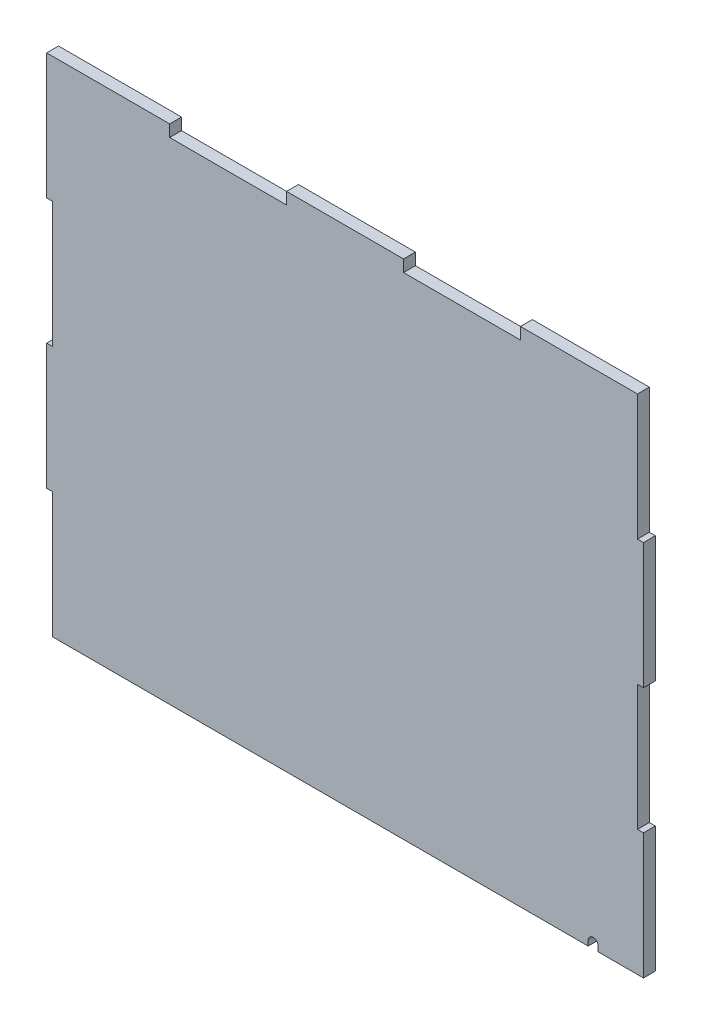
ISO-10303-21;
HEADER;
FILE_DESCRIPTION(('STEP AP214'),'2;1');
FILE_NAME('part.step','',(''),(''),'','','');
FILE_SCHEMA(('AUTOMOTIVE_DESIGN { 1 0 10303 214 1 1 1 1 }'));
ENDSEC;
DATA;
#1=APPLICATION_CONTEXT('core data for automotive mechanical design processes');
#2=APPLICATION_PROTOCOL_DEFINITION('international standard','automotive_design',2000,#1);
#3=PRODUCT_CONTEXT('',#1,'mechanical');
#4=PRODUCT('Part','Part','',(#3));
#5=PRODUCT_RELATED_PRODUCT_CATEGORY('part','',(#4));
#6=PRODUCT_DEFINITION_FORMATION('','',#4);
#7=PRODUCT_DEFINITION_CONTEXT('part definition',#1,'design');
#8=PRODUCT_DEFINITION('design','',#6,#7);
#9=PRODUCT_DEFINITION_SHAPE('','',#8);
#10=(LENGTH_UNIT() NAMED_UNIT(*) SI_UNIT(.MILLI.,.METRE.));
#11=(NAMED_UNIT(*) PLANE_ANGLE_UNIT() SI_UNIT($,.RADIAN.));
#12=(NAMED_UNIT(*) SI_UNIT($,.STERADIAN.) SOLID_ANGLE_UNIT());
#13=UNCERTAINTY_MEASURE_WITH_UNIT(LENGTH_MEASURE(1.E-05),#10,'distance_accuracy_value','');
#14=(GEOMETRIC_REPRESENTATION_CONTEXT(3) GLOBAL_UNCERTAINTY_ASSIGNED_CONTEXT((#13)) GLOBAL_UNIT_ASSIGNED_CONTEXT((#10,
#11,#12)) REPRESENTATION_CONTEXT('',''));
#15=CARTESIAN_POINT('',(0.,0.,0.));
#16=DIRECTION('',(0.,0.,1.));
#17=DIRECTION('',(1.,0.,0.));
#18=AXIS2_PLACEMENT_3D('',#15,#16,#17);
#19=CARTESIAN_POINT('',(0.,0.,5.9944));
#20=DIRECTION('',(0.,1.,0.));
#21=DIRECTION('',(0.,0.,1.));
#22=AXIS2_PLACEMENT_3D('',#19,#20,#21);
#23=PLANE('',#22);
#24=DIRECTION('',(0.,0.,1.));
#25=VECTOR('',#24,1.);
#26=CARTESIAN_POINT('',(275.59,0.,-0.00100000000000013));
#27=LINE('',#26,#25);
#28=CARTESIAN_POINT('',(275.59,0.,0.));
#29=VERTEX_POINT('',#28);
#30=CARTESIAN_POINT('',(275.59,0.,5.9944));
#31=VERTEX_POINT('',#30);
#32=EDGE_CURVE('E423',#29,#31,#27,.T.);
#33=ORIENTED_EDGE('',*,*,#32,.F.);
#34=DIRECTION('',(1.,0.,0.));
#35=VECTOR('',#34,1.);
#36=CARTESIAN_POINT('',(0.,0.,0.));
#37=LINE('',#36,#35);
#38=CARTESIAN_POINT('',(298.45,0.,0.));
#39=VERTEX_POINT('',#38);
#40=EDGE_CURVE('E257',#29,#39,#37,.T.);
#41=ORIENTED_EDGE('',*,*,#40,.T.);
#42=DIRECTION('',(0.,0.,-1.));
#43=VECTOR('',#42,1.);
#44=CARTESIAN_POINT('',(298.45,0.,5.9944));
#45=LINE('',#44,#43);
#46=CARTESIAN_POINT('',(298.45,0.,5.9944));
#47=VERTEX_POINT('',#46);
#48=EDGE_CURVE('E321',#47,#39,#45,.T.);
#49=ORIENTED_EDGE('',*,*,#48,.F.);
#50=DIRECTION('',(1.,0.,0.));
#51=VECTOR('',#50,1.);
#52=CARTESIAN_POINT('',(0.,0.,5.9944));
#53=LINE('',#52,#51);
#54=EDGE_CURVE('E381',#31,#47,#53,.T.);
#55=ORIENTED_EDGE('',*,*,#54,.F.);
#56=EDGE_LOOP('',(#33,#41,#49,#55));
#57=FACE_BOUND('',#56,.T.);
#58=ADVANCED_FACE('F32',(#57),#23,.F.);
#59=CARTESIAN_POINT('',(0.,0.,5.9944));
#60=DIRECTION('',(0.,0.,1.));
#61=DIRECTION('',(1.,0.,0.));
#62=AXIS2_PLACEMENT_3D('',#59,#60,#61);
#63=PLANE('',#62);
#64=CARTESIAN_POINT('',(273.05,2.54,5.9944));
#65=DIRECTION('',(0.,0.,1.));
#66=DIRECTION('',(1.,0.,0.));
#67=AXIS2_PLACEMENT_3D('',#64,#65,#66);
#68=CIRCLE('',#67,2.53999999999999);
#69=CARTESIAN_POINT('',(275.59,2.54,5.9944));
#70=VERTEX_POINT('',#69);
#71=CARTESIAN_POINT('',(270.51,2.54,5.9944));
#72=VERTEX_POINT('',#71);
#73=EDGE_CURVE('E434',#70,#72,#68,.T.);
#74=ORIENTED_EDGE('',*,*,#73,.F.);
#75=DIRECTION('',(0.,-1.,0.));
#76=VECTOR('',#75,1.);
#77=CARTESIAN_POINT('',(275.59,2.54,5.9944));
#78=LINE('',#77,#76);
#79=EDGE_CURVE('E440',#70,#31,#78,.T.);
#80=ORIENTED_EDGE('',*,*,#79,.T.);
#81=ORIENTED_EDGE('',*,*,#54,.T.);
#82=DIRECTION('',(0.,1.,0.));
#83=VECTOR('',#82,1.);
#84=CARTESIAN_POINT('',(298.45,0.,5.9944));
#85=LINE('',#84,#83);
#86=CARTESIAN_POINT('',(298.45,63.5,5.9944));
#87=VERTEX_POINT('',#86);
#88=EDGE_CURVE('E385',#47,#87,#85,.T.);
#89=ORIENTED_EDGE('',*,*,#88,.T.);
#90=DIRECTION('',(-1.,0.,0.));
#91=VECTOR('',#90,1.);
#92=CARTESIAN_POINT('',(298.45,63.5,5.9944));
#93=LINE('',#92,#91);
#94=CARTESIAN_POINT('',(295.402,63.5,5.9944));
#95=VERTEX_POINT('',#94);
#96=EDGE_CURVE('E387',#87,#95,#93,.T.);
#97=ORIENTED_EDGE('',*,*,#96,.T.);
#98=DIRECTION('',(0.,1.,0.));
#99=VECTOR('',#98,1.);
#100=CARTESIAN_POINT('',(295.402,63.5,5.9944));
#101=LINE('',#100,#99);
#102=CARTESIAN_POINT('',(295.402,126.981711341585,5.9944));
#103=VERTEX_POINT('',#102);
#104=EDGE_CURVE('E389',#95,#103,#101,.T.);
#105=ORIENTED_EDGE('',*,*,#104,.T.);
#106=DIRECTION('',(1.,0.,0.));
#107=VECTOR('',#106,1.);
#108=CARTESIAN_POINT('',(295.402,126.981711341585,5.9944));
#109=LINE('',#108,#107);
#110=CARTESIAN_POINT('',(298.45,126.981711341585,5.9944));
#111=VERTEX_POINT('',#110);
#112=EDGE_CURVE('E391',#103,#111,#109,.T.);
#113=ORIENTED_EDGE('',*,*,#112,.T.);
#114=DIRECTION('',(0.,1.,0.));
#115=VECTOR('',#114,1.);
#116=CARTESIAN_POINT('',(298.45,126.981711341585,5.9944));
#117=LINE('',#116,#115);
#118=CARTESIAN_POINT('',(298.45,190.481711341585,5.9944));
#119=VERTEX_POINT('',#118);
#120=EDGE_CURVE('E393',#111,#119,#117,.T.);
#121=ORIENTED_EDGE('',*,*,#120,.T.);
#122=DIRECTION('',(-1.,0.,0.));
#123=VECTOR('',#122,1.);
#124=CARTESIAN_POINT('',(298.45,190.481711341585,5.9944));
#125=LINE('',#124,#123);
#126=CARTESIAN_POINT('',(295.402,190.481711341585,5.9944));
#127=VERTEX_POINT('',#126);
#128=EDGE_CURVE('E395',#119,#127,#125,.T.);
#129=ORIENTED_EDGE('',*,*,#128,.T.);
#130=DIRECTION('',(0.,1.,0.));
#131=VECTOR('',#130,1.);
#132=CARTESIAN_POINT('',(295.402,190.481711341585,5.9944));
#133=LINE('',#132,#131);
#134=CARTESIAN_POINT('',(295.402,253.981711341585,5.9944));
#135=VERTEX_POINT('',#134);
#136=EDGE_CURVE('E397',#127,#135,#133,.T.);
#137=ORIENTED_EDGE('',*,*,#136,.T.);
#138=DIRECTION('',(-1.,0.,0.));
#139=VECTOR('',#138,1.);
#140=CARTESIAN_POINT('',(236.3216,253.981711341585,5.9944));
#141=LINE('',#140,#139);
#142=CARTESIAN_POINT('',(236.3216,253.981711341585,5.9944));
#143=VERTEX_POINT('',#142);
#144=EDGE_CURVE('E399',#135,#143,#141,.T.);
#145=ORIENTED_EDGE('',*,*,#144,.T.);
#146=DIRECTION('',(0.,-1.,0.));
#147=VECTOR('',#146,1.);
#148=CARTESIAN_POINT('',(236.3216,248.012711341585,5.9944));
#149=LINE('',#148,#147);
#150=CARTESIAN_POINT('',(236.3216,248.012711341585,5.9944));
#151=VERTEX_POINT('',#150);
#152=EDGE_CURVE('E401',#143,#151,#149,.T.);
#153=ORIENTED_EDGE('',*,*,#152,.T.);
#154=DIRECTION('',(-1.,0.,0.));
#155=VECTOR('',#154,1.);
#156=CARTESIAN_POINT('',(177.2412,248.012711341585,5.9944));
#157=LINE('',#156,#155);
#158=CARTESIAN_POINT('',(177.2412,248.012711341585,5.9944));
#159=VERTEX_POINT('',#158);
#160=EDGE_CURVE('E403',#151,#159,#157,.T.);
#161=ORIENTED_EDGE('',*,*,#160,.T.);
#162=DIRECTION('',(0.,1.,0.));
#163=VECTOR('',#162,1.);
#164=CARTESIAN_POINT('',(177.2412,253.981711341585,5.9944));
#165=LINE('',#164,#163);
#166=CARTESIAN_POINT('',(177.2412,253.981711341585,5.9944));
#167=VERTEX_POINT('',#166);
#168=EDGE_CURVE('E216',#159,#167,#165,.T.);
#169=ORIENTED_EDGE('',*,*,#168,.T.);
#170=DIRECTION('',(-1.,0.,0.));
#171=VECTOR('',#170,1.);
#172=CARTESIAN_POINT('',(118.1608,253.981711341585,5.9944));
#173=LINE('',#172,#171);
#174=CARTESIAN_POINT('',(118.1608,253.981711341585,5.9944));
#175=VERTEX_POINT('',#174);
#176=EDGE_CURVE('E208',#167,#175,#173,.T.);
#177=ORIENTED_EDGE('',*,*,#176,.T.);
#178=DIRECTION('',(0.,-1.,0.));
#179=VECTOR('',#178,1.);
#180=CARTESIAN_POINT('',(118.1608,248.012711341585,5.9944));
#181=LINE('',#180,#179);
#182=CARTESIAN_POINT('',(118.1608,248.012711341585,5.9944));
#183=VERTEX_POINT('',#182);
#184=EDGE_CURVE('E213',#175,#183,#181,.T.);
#185=ORIENTED_EDGE('',*,*,#184,.T.);
#186=DIRECTION('',(-1.,0.,0.));
#187=VECTOR('',#186,1.);
#188=CARTESIAN_POINT('',(59.0804,248.012711341585,5.9944));
#189=LINE('',#188,#187);
#190=CARTESIAN_POINT('',(59.0804,248.012711341585,5.9944));
#191=VERTEX_POINT('',#190);
#192=EDGE_CURVE('E56',#183,#191,#189,.T.);
#193=ORIENTED_EDGE('',*,*,#192,.T.);
#194=DIRECTION('',(0.,1.,0.));
#195=VECTOR('',#194,1.);
#196=CARTESIAN_POINT('',(59.0804,253.981711341585,5.9944));
#197=LINE('',#196,#195);
#198=CARTESIAN_POINT('',(59.0804,253.981711341585,5.9944));
#199=VERTEX_POINT('',#198);
#200=EDGE_CURVE('E287',#191,#199,#197,.T.);
#201=ORIENTED_EDGE('',*,*,#200,.T.);
#202=DIRECTION('',(-1.,0.,0.));
#203=VECTOR('',#202,1.);
#204=CARTESIAN_POINT('',(-3.048,253.981711341585,5.9944));
#205=LINE('',#204,#203);
#206=CARTESIAN_POINT('',(-3.048,253.981711341585,5.9944));
#207=VERTEX_POINT('',#206);
#208=EDGE_CURVE('E145',#199,#207,#205,.T.);
#209=ORIENTED_EDGE('',*,*,#208,.T.);
#210=DIRECTION('',(0.,-1.,0.));
#211=VECTOR('',#210,1.);
#212=CARTESIAN_POINT('',(-3.048,190.5,5.9944));
#213=LINE('',#212,#211);
#214=CARTESIAN_POINT('',(-3.048,190.5,5.9944));
#215=VERTEX_POINT('',#214);
#216=EDGE_CURVE('E350',#207,#215,#213,.T.);
#217=ORIENTED_EDGE('',*,*,#216,.T.);
#218=DIRECTION('',(1.,0.,0.));
#219=VECTOR('',#218,1.);
#220=CARTESIAN_POINT('',(0.,190.5,5.9944));
#221=LINE('',#220,#219);
#222=CARTESIAN_POINT('',(0.,190.5,5.9944));
#223=VERTEX_POINT('',#222);
#224=EDGE_CURVE('E369',#215,#223,#221,.T.);
#225=ORIENTED_EDGE('',*,*,#224,.T.);
#226=DIRECTION('',(0.,-1.,0.));
#227=VECTOR('',#226,1.);
#228=CARTESIAN_POINT('',(0.,127.,5.9944));
#229=LINE('',#228,#227);
#230=CARTESIAN_POINT('',(0.,127.,5.9944));
#231=VERTEX_POINT('',#230);
#232=EDGE_CURVE('E366',#223,#231,#229,.T.);
#233=ORIENTED_EDGE('',*,*,#232,.T.);
#234=DIRECTION('',(-1.,0.,0.));
#235=VECTOR('',#234,1.);
#236=CARTESIAN_POINT('',(0.,127.,5.9944));
#237=LINE('',#236,#235);
#238=CARTESIAN_POINT('',(-3.048,127.,5.9944));
#239=VERTEX_POINT('',#238);
#240=EDGE_CURVE('E368',#231,#239,#237,.T.);
#241=ORIENTED_EDGE('',*,*,#240,.T.);
#242=DIRECTION('',(0.,-1.,0.));
#243=VECTOR('',#242,1.);
#244=CARTESIAN_POINT('',(-3.048,63.5,5.9944));
#245=LINE('',#244,#243);
#246=CARTESIAN_POINT('',(-3.048,63.5,5.9944));
#247=VERTEX_POINT('',#246);
#248=EDGE_CURVE('E371',#239,#247,#245,.T.);
#249=ORIENTED_EDGE('',*,*,#248,.T.);
#250=DIRECTION('',(1.,0.,0.));
#251=VECTOR('',#250,1.);
#252=CARTESIAN_POINT('',(0.,63.5,5.9944));
#253=LINE('',#252,#251);
#254=CARTESIAN_POINT('',(0.,63.5,5.9944));
#255=VERTEX_POINT('',#254);
#256=EDGE_CURVE('E377',#247,#255,#253,.T.);
#257=ORIENTED_EDGE('',*,*,#256,.T.);
#258=DIRECTION('',(0.,-1.,0.));
#259=VECTOR('',#258,1.);
#260=CARTESIAN_POINT('',(0.,0.,5.9944));
#261=LINE('',#260,#259);
#262=CARTESIAN_POINT('',(0.,0.,5.9944));
#263=VERTEX_POINT('',#262);
#264=EDGE_CURVE('E379',#255,#263,#261,.T.);
#265=ORIENTED_EDGE('',*,*,#264,.T.);
#266=CARTESIAN_POINT('',(270.51,0.,5.9944));
#267=VERTEX_POINT('',#266);
#268=EDGE_CURVE('E382',#263,#267,#53,.T.);
#269=ORIENTED_EDGE('',*,*,#268,.T.);
#270=DIRECTION('',(0.,-1.,0.));
#271=VECTOR('',#270,1.);
#272=CARTESIAN_POINT('',(270.51,2.54,5.9944));
#273=LINE('',#272,#271);
#274=EDGE_CURVE('E437',#72,#267,#273,.T.);
#275=ORIENTED_EDGE('',*,*,#274,.F.);
#276=EDGE_LOOP('',(#74,#80,#81,#89,#97,#105,#113,#121,#129,#137,#145,#153,#161,#169,#177,#185,
#193,#201,#209,#217,#225,#233,#241,#249,#257,#265,#269,#275));
#277=FACE_BOUND('',#276,.T.);
#278=ADVANCED_FACE('F211',(#277),#63,.T.);
#279=CARTESIAN_POINT('',(0.,0.,0.));
#280=DIRECTION('',(0.,0.,1.));
#281=DIRECTION('',(1.,0.,0.));
#282=AXIS2_PLACEMENT_3D('',#279,#280,#281);
#283=PLANE('',#282);
#284=DIRECTION('',(0.,1.,0.));
#285=VECTOR('',#284,1.);
#286=CARTESIAN_POINT('',(275.59,2.54,0.));
#287=LINE('',#286,#285);
#288=CARTESIAN_POINT('',(275.59,2.54,0.));
#289=VERTEX_POINT('',#288);
#290=EDGE_CURVE('E443',#29,#289,#287,.T.);
#291=ORIENTED_EDGE('',*,*,#290,.T.);
#292=CARTESIAN_POINT('',(273.05,2.54,0.));
#293=DIRECTION('',(0.,0.,1.));
#294=DIRECTION('',(1.,0.,0.));
#295=AXIS2_PLACEMENT_3D('',#292,#293,#294);
#296=CIRCLE('',#295,2.53999999999999);
#297=CARTESIAN_POINT('',(270.51,2.54,0.));
#298=VERTEX_POINT('',#297);
#299=EDGE_CURVE('E241',#298,#289,#296,.F.);
#300=ORIENTED_EDGE('',*,*,#299,.F.);
#301=DIRECTION('',(0.,1.,0.));
#302=VECTOR('',#301,1.);
#303=CARTESIAN_POINT('',(270.51,2.54,0.));
#304=LINE('',#303,#302);
#305=CARTESIAN_POINT('',(270.51,0.,0.));
#306=VERTEX_POINT('',#305);
#307=EDGE_CURVE('E47',#306,#298,#304,.T.);
#308=ORIENTED_EDGE('',*,*,#307,.F.);
#309=CARTESIAN_POINT('',(0.,0.,0.));
#310=VERTEX_POINT('',#309);
#311=EDGE_CURVE('E258',#310,#306,#37,.T.);
#312=ORIENTED_EDGE('',*,*,#311,.F.);
#313=DIRECTION('',(0.,-1.,0.));
#314=VECTOR('',#313,1.);
#315=CARTESIAN_POINT('',(0.,0.,0.));
#316=LINE('',#315,#314);
#317=CARTESIAN_POINT('',(0.,63.5,0.));
#318=VERTEX_POINT('',#317);
#319=EDGE_CURVE('E255',#318,#310,#316,.T.);
#320=ORIENTED_EDGE('',*,*,#319,.F.);
#321=DIRECTION('',(1.,0.,0.));
#322=VECTOR('',#321,1.);
#323=CARTESIAN_POINT('',(0.,63.5,0.));
#324=LINE('',#323,#322);
#325=CARTESIAN_POINT('',(-3.048,63.5,0.));
#326=VERTEX_POINT('',#325);
#327=EDGE_CURVE('E253',#326,#318,#324,.T.);
#328=ORIENTED_EDGE('',*,*,#327,.F.);
#329=DIRECTION('',(0.,-1.,0.));
#330=VECTOR('',#329,1.);
#331=CARTESIAN_POINT('',(-3.048,63.5,0.));
#332=LINE('',#331,#330);
#333=CARTESIAN_POINT('',(-3.048,127.,0.));
#334=VERTEX_POINT('',#333);
#335=EDGE_CURVE('E251',#334,#326,#332,.T.);
#336=ORIENTED_EDGE('',*,*,#335,.F.);
#337=DIRECTION('',(-1.,0.,0.));
#338=VECTOR('',#337,1.);
#339=CARTESIAN_POINT('',(0.,127.,0.));
#340=LINE('',#339,#338);
#341=CARTESIAN_POINT('',(0.,127.,0.));
#342=VERTEX_POINT('',#341);
#343=EDGE_CURVE('E249',#342,#334,#340,.T.);
#344=ORIENTED_EDGE('',*,*,#343,.F.);
#345=DIRECTION('',(0.,-1.,0.));
#346=VECTOR('',#345,1.);
#347=CARTESIAN_POINT('',(0.,127.,0.));
#348=LINE('',#347,#346);
#349=CARTESIAN_POINT('',(0.,190.5,0.));
#350=VERTEX_POINT('',#349);
#351=EDGE_CURVE('E247',#350,#342,#348,.T.);
#352=ORIENTED_EDGE('',*,*,#351,.F.);
#353=DIRECTION('',(1.,0.,0.));
#354=VECTOR('',#353,1.);
#355=CARTESIAN_POINT('',(0.,190.5,0.));
#356=LINE('',#355,#354);
#357=CARTESIAN_POINT('',(-3.048,190.5,0.));
#358=VERTEX_POINT('',#357);
#359=EDGE_CURVE('E245',#358,#350,#356,.T.);
#360=ORIENTED_EDGE('',*,*,#359,.F.);
#361=DIRECTION('',(0.,-1.,0.));
#362=VECTOR('',#361,1.);
#363=CARTESIAN_POINT('',(-3.048,190.5,0.));
#364=LINE('',#363,#362);
#365=CARTESIAN_POINT('',(-3.048,253.981711341585,0.));
#366=VERTEX_POINT('',#365);
#367=EDGE_CURVE('E243',#366,#358,#364,.T.);
#368=ORIENTED_EDGE('',*,*,#367,.F.);
#369=DIRECTION('',(-1.,0.,0.));
#370=VECTOR('',#369,1.);
#371=CARTESIAN_POINT('',(-3.048,253.981711341585,0.));
#372=LINE('',#371,#370);
#373=CARTESIAN_POINT('',(59.0804,253.981711341585,0.));
#374=VERTEX_POINT('',#373);
#375=EDGE_CURVE('E240',#374,#366,#372,.T.);
#376=ORIENTED_EDGE('',*,*,#375,.F.);
#377=DIRECTION('',(0.,1.,0.));
#378=VECTOR('',#377,1.);
#379=CARTESIAN_POINT('',(59.0804,253.981711341585,0.));
#380=LINE('',#379,#378);
#381=CARTESIAN_POINT('',(59.0804,248.012711341585,0.));
#382=VERTEX_POINT('',#381);
#383=EDGE_CURVE('E237',#382,#374,#380,.T.);
#384=ORIENTED_EDGE('',*,*,#383,.F.);
#385=DIRECTION('',(-1.,0.,0.));
#386=VECTOR('',#385,1.);
#387=CARTESIAN_POINT('',(59.0804,248.012711341585,0.));
#388=LINE('',#387,#386);
#389=CARTESIAN_POINT('',(118.1608,248.012711341585,0.));
#390=VERTEX_POINT('',#389);
#391=EDGE_CURVE('E137',#390,#382,#388,.T.);
#392=ORIENTED_EDGE('',*,*,#391,.F.);
#393=DIRECTION('',(0.,-1.,0.));
#394=VECTOR('',#393,1.);
#395=CARTESIAN_POINT('',(118.1608,248.012711341585,0.));
#396=LINE('',#395,#394);
#397=CARTESIAN_POINT('',(118.1608,253.981711341585,0.));
#398=VERTEX_POINT('',#397);
#399=EDGE_CURVE('E284',#398,#390,#396,.T.);
#400=ORIENTED_EDGE('',*,*,#399,.F.);
#401=DIRECTION('',(-1.,0.,0.));
#402=VECTOR('',#401,1.);
#403=CARTESIAN_POINT('',(118.1608,253.981711341585,0.));
#404=LINE('',#403,#402);
#405=CARTESIAN_POINT('',(177.2412,253.981711341585,0.));
#406=VERTEX_POINT('',#405);
#407=EDGE_CURVE('E225',#406,#398,#404,.T.);
#408=ORIENTED_EDGE('',*,*,#407,.F.);
#409=DIRECTION('',(0.,1.,0.));
#410=VECTOR('',#409,1.);
#411=CARTESIAN_POINT('',(177.2412,253.981711341585,0.));
#412=LINE('',#411,#410);
#413=CARTESIAN_POINT('',(177.2412,248.012711341585,0.));
#414=VERTEX_POINT('',#413);
#415=EDGE_CURVE('E281',#414,#406,#412,.T.);
#416=ORIENTED_EDGE('',*,*,#415,.F.);
#417=DIRECTION('',(-1.,0.,0.));
#418=VECTOR('',#417,1.);
#419=CARTESIAN_POINT('',(177.2412,248.012711341585,0.));
#420=LINE('',#419,#418);
#421=CARTESIAN_POINT('',(236.3216,248.012711341585,0.));
#422=VERTEX_POINT('',#421);
#423=EDGE_CURVE('E279',#422,#414,#420,.T.);
#424=ORIENTED_EDGE('',*,*,#423,.F.);
#425=DIRECTION('',(0.,-1.,0.));
#426=VECTOR('',#425,1.);
#427=CARTESIAN_POINT('',(236.3216,248.012711341585,0.));
#428=LINE('',#427,#426);
#429=CARTESIAN_POINT('',(236.3216,253.981711341585,0.));
#430=VERTEX_POINT('',#429);
#431=EDGE_CURVE('E277',#430,#422,#428,.T.);
#432=ORIENTED_EDGE('',*,*,#431,.F.);
#433=DIRECTION('',(-1.,0.,0.));
#434=VECTOR('',#433,1.);
#435=CARTESIAN_POINT('',(236.3216,253.981711341585,0.));
#436=LINE('',#435,#434);
#437=CARTESIAN_POINT('',(295.402,253.981711341585,0.));
#438=VERTEX_POINT('',#437);
#439=EDGE_CURVE('E275',#438,#430,#436,.T.);
#440=ORIENTED_EDGE('',*,*,#439,.F.);
#441=DIRECTION('',(0.,1.,0.));
#442=VECTOR('',#441,1.);
#443=CARTESIAN_POINT('',(295.402,190.481711341585,0.));
#444=LINE('',#443,#442);
#445=CARTESIAN_POINT('',(295.402,190.481711341585,0.));
#446=VERTEX_POINT('',#445);
#447=EDGE_CURVE('E273',#446,#438,#444,.T.);
#448=ORIENTED_EDGE('',*,*,#447,.F.);
#449=DIRECTION('',(-1.,0.,0.));
#450=VECTOR('',#449,1.);
#451=CARTESIAN_POINT('',(298.45,190.481711341585,0.));
#452=LINE('',#451,#450);
#453=CARTESIAN_POINT('',(298.45,190.481711341585,0.));
#454=VERTEX_POINT('',#453);
#455=EDGE_CURVE('E271',#454,#446,#452,.T.);
#456=ORIENTED_EDGE('',*,*,#455,.F.);
#457=DIRECTION('',(0.,1.,0.));
#458=VECTOR('',#457,1.);
#459=CARTESIAN_POINT('',(298.45,126.981711341585,0.));
#460=LINE('',#459,#458);
#461=CARTESIAN_POINT('',(298.45,126.981711341585,0.));
#462=VERTEX_POINT('',#461);
#463=EDGE_CURVE('E269',#462,#454,#460,.T.);
#464=ORIENTED_EDGE('',*,*,#463,.F.);
#465=DIRECTION('',(1.,0.,0.));
#466=VECTOR('',#465,1.);
#467=CARTESIAN_POINT('',(295.402,126.981711341585,0.));
#468=LINE('',#467,#466);
#469=CARTESIAN_POINT('',(295.402,126.981711341585,0.));
#470=VERTEX_POINT('',#469);
#471=EDGE_CURVE('E267',#470,#462,#468,.T.);
#472=ORIENTED_EDGE('',*,*,#471,.F.);
#473=DIRECTION('',(0.,1.,0.));
#474=VECTOR('',#473,1.);
#475=CARTESIAN_POINT('',(295.402,63.5,0.));
#476=LINE('',#475,#474);
#477=CARTESIAN_POINT('',(295.402,63.5,0.));
#478=VERTEX_POINT('',#477);
#479=EDGE_CURVE('E265',#478,#470,#476,.T.);
#480=ORIENTED_EDGE('',*,*,#479,.F.);
#481=DIRECTION('',(-1.,0.,0.));
#482=VECTOR('',#481,1.);
#483=CARTESIAN_POINT('',(298.45,63.5,0.));
#484=LINE('',#483,#482);
#485=CARTESIAN_POINT('',(298.45,63.5,0.));
#486=VERTEX_POINT('',#485);
#487=EDGE_CURVE('E263',#486,#478,#484,.T.);
#488=ORIENTED_EDGE('',*,*,#487,.F.);
#489=DIRECTION('',(0.,1.,0.));
#490=VECTOR('',#489,1.);
#491=CARTESIAN_POINT('',(298.45,0.,0.));
#492=LINE('',#491,#490);
#493=EDGE_CURVE('E261',#39,#486,#492,.T.);
#494=ORIENTED_EDGE('',*,*,#493,.F.);
#495=ORIENTED_EDGE('',*,*,#40,.F.);
#496=EDGE_LOOP('',(#291,#300,#308,#312,#320,#328,#336,#344,#352,#360,#368,#376,#384,#392,#400,
#408,#416,#424,#432,#440,#448,#456,#464,#472,#480,#488,#494,#495));
#497=FACE_BOUND('',#496,.T.);
#498=ADVANCED_FACE('F354',(#497),#283,.F.);
#499=CARTESIAN_POINT('',(59.0804,253.981711341585,5.9944));
#500=DIRECTION('',(-1.,0.,0.));
#501=DIRECTION('',(0.,0.,1.));
#502=AXIS2_PLACEMENT_3D('',#499,#500,#501);
#503=PLANE('',#502);
#504=ORIENTED_EDGE('',*,*,#383,.T.);
#505=DIRECTION('',(0.,0.,-1.));
#506=VECTOR('',#505,1.);
#507=CARTESIAN_POINT('',(59.0804,253.981711341585,5.9944));
#508=LINE('',#507,#506);
#509=EDGE_CURVE('E11',#199,#374,#508,.T.);
#510=ORIENTED_EDGE('',*,*,#509,.F.);
#511=ORIENTED_EDGE('',*,*,#200,.F.);
#512=DIRECTION('',(0.,0.,-1.));
#513=VECTOR('',#512,1.);
#514=CARTESIAN_POINT('',(59.0804,248.012711341585,5.9944));
#515=LINE('',#514,#513);
#516=EDGE_CURVE('E233',#191,#382,#515,.T.);
#517=ORIENTED_EDGE('',*,*,#516,.T.);
#518=EDGE_LOOP('',(#504,#510,#511,#517));
#519=FACE_BOUND('',#518,.T.);
#520=ADVANCED_FACE('F34',(#519),#503,.F.);
#521=CARTESIAN_POINT('',(-3.048,253.981711341585,5.9944));
#522=DIRECTION('',(0.,-1.,0.));
#523=DIRECTION('',(0.,0.,-1.));
#524=AXIS2_PLACEMENT_3D('',#521,#522,#523);
#525=PLANE('',#524);
#526=ORIENTED_EDGE('',*,*,#375,.T.);
#527=DIRECTION('',(0.,0.,-1.));
#528=VECTOR('',#527,1.);
#529=CARTESIAN_POINT('',(-3.048,253.981711341585,5.9944));
#530=LINE('',#529,#528);
#531=EDGE_CURVE('E40',#207,#366,#530,.T.);
#532=ORIENTED_EDGE('',*,*,#531,.F.);
#533=ORIENTED_EDGE('',*,*,#208,.F.);
#534=ORIENTED_EDGE('',*,*,#509,.T.);
#535=EDGE_LOOP('',(#526,#532,#533,#534));
#536=FACE_BOUND('',#535,.T.);
#537=ADVANCED_FACE('F556',(#536),#525,.F.);
#538=CARTESIAN_POINT('',(-3.048,190.5,5.9944));
#539=DIRECTION('',(1.,0.,0.));
#540=DIRECTION('',(0.,0.,-1.));
#541=AXIS2_PLACEMENT_3D('',#538,#539,#540);
#542=PLANE('',#541);
#543=ORIENTED_EDGE('',*,*,#367,.T.);
#544=DIRECTION('',(0.,0.,-1.));
#545=VECTOR('',#544,1.);
#546=CARTESIAN_POINT('',(-3.048,190.5,5.9944));
#547=LINE('',#546,#545);
#548=EDGE_CURVE('E342',#215,#358,#547,.T.);
#549=ORIENTED_EDGE('',*,*,#548,.F.);
#550=ORIENTED_EDGE('',*,*,#216,.F.);
#551=ORIENTED_EDGE('',*,*,#531,.T.);
#552=EDGE_LOOP('',(#543,#549,#550,#551));
#553=FACE_BOUND('',#552,.T.);
#554=ADVANCED_FACE('F348',(#553),#542,.F.);
#555=CARTESIAN_POINT('',(0.,190.5,5.9944));
#556=DIRECTION('',(0.,1.,0.));
#557=DIRECTION('',(0.,0.,1.));
#558=AXIS2_PLACEMENT_3D('',#555,#556,#557);
#559=PLANE('',#558);
#560=ORIENTED_EDGE('',*,*,#359,.T.);
#561=DIRECTION('',(0.,0.,-1.));
#562=VECTOR('',#561,1.);
#563=CARTESIAN_POINT('',(0.,190.5,5.9944));
#564=LINE('',#563,#562);
#565=EDGE_CURVE('E339',#223,#350,#564,.T.);
#566=ORIENTED_EDGE('',*,*,#565,.F.);
#567=ORIENTED_EDGE('',*,*,#224,.F.);
#568=ORIENTED_EDGE('',*,*,#548,.T.);
#569=EDGE_LOOP('',(#560,#566,#567,#568));
#570=FACE_BOUND('',#569,.T.);
#571=ADVANCED_FACE('F360',(#570),#559,.F.);
#572=CARTESIAN_POINT('',(0.,127.,5.9944));
#573=DIRECTION('',(1.,0.,0.));
#574=DIRECTION('',(0.,0.,-1.));
#575=AXIS2_PLACEMENT_3D('',#572,#573,#574);
#576=PLANE('',#575);
#577=ORIENTED_EDGE('',*,*,#351,.T.);
#578=DIRECTION('',(0.,0.,-1.));
#579=VECTOR('',#578,1.);
#580=CARTESIAN_POINT('',(0.,127.,5.9944));
#581=LINE('',#580,#579);
#582=EDGE_CURVE('E336',#231,#342,#581,.T.);
#583=ORIENTED_EDGE('',*,*,#582,.F.);
#584=ORIENTED_EDGE('',*,*,#232,.F.);
#585=ORIENTED_EDGE('',*,*,#565,.T.);
#586=EDGE_LOOP('',(#577,#583,#584,#585));
#587=FACE_BOUND('',#586,.T.);
#588=ADVANCED_FACE('F364',(#587),#576,.F.);
#589=CARTESIAN_POINT('',(0.,127.,5.9944));
#590=DIRECTION('',(0.,-1.,0.));
#591=DIRECTION('',(0.,0.,-1.));
#592=AXIS2_PLACEMENT_3D('',#589,#590,#591);
#593=PLANE('',#592);
#594=ORIENTED_EDGE('',*,*,#343,.T.);
#595=DIRECTION('',(0.,0.,-1.));
#596=VECTOR('',#595,1.);
#597=CARTESIAN_POINT('',(-3.048,127.,5.9944));
#598=LINE('',#597,#596);
#599=EDGE_CURVE('E333',#239,#334,#598,.T.);
#600=ORIENTED_EDGE('',*,*,#599,.F.);
#601=ORIENTED_EDGE('',*,*,#240,.F.);
#602=ORIENTED_EDGE('',*,*,#582,.T.);
#603=EDGE_LOOP('',(#594,#600,#601,#602));
#604=FACE_BOUND('',#603,.T.);
#605=ADVANCED_FACE('F494',(#604),#593,.F.);
#606=CARTESIAN_POINT('',(-3.048,63.5,5.9944));
#607=DIRECTION('',(1.,0.,0.));
#608=DIRECTION('',(0.,0.,-1.));
#609=AXIS2_PLACEMENT_3D('',#606,#607,#608);
#610=PLANE('',#609);
#611=ORIENTED_EDGE('',*,*,#335,.T.);
#612=DIRECTION('',(0.,0.,-1.));
#613=VECTOR('',#612,1.);
#614=CARTESIAN_POINT('',(-3.048,63.5,5.9944));
#615=LINE('',#614,#613);
#616=EDGE_CURVE('E330',#247,#326,#615,.T.);
#617=ORIENTED_EDGE('',*,*,#616,.F.);
#618=ORIENTED_EDGE('',*,*,#248,.F.);
#619=ORIENTED_EDGE('',*,*,#599,.T.);
#620=EDGE_LOOP('',(#611,#617,#618,#619));
#621=FACE_BOUND('',#620,.T.);
#622=ADVANCED_FACE('F491',(#621),#610,.F.);
#623=CARTESIAN_POINT('',(0.,63.5,5.9944));
#624=DIRECTION('',(0.,1.,0.));
#625=DIRECTION('',(0.,0.,1.));
#626=AXIS2_PLACEMENT_3D('',#623,#624,#625);
#627=PLANE('',#626);
#628=ORIENTED_EDGE('',*,*,#327,.T.);
#629=DIRECTION('',(0.,0.,-1.));
#630=VECTOR('',#629,1.);
#631=CARTESIAN_POINT('',(0.,63.5,5.9944));
#632=LINE('',#631,#630);
#633=EDGE_CURVE('E327',#255,#318,#632,.T.);
#634=ORIENTED_EDGE('',*,*,#633,.F.);
#635=ORIENTED_EDGE('',*,*,#256,.F.);
#636=ORIENTED_EDGE('',*,*,#616,.T.);
#637=EDGE_LOOP('',(#628,#634,#635,#636));
#638=FACE_BOUND('',#637,.T.);
#639=ADVANCED_FACE('F487',(#638),#627,.F.);
#640=CARTESIAN_POINT('',(0.,0.,5.9944));
#641=DIRECTION('',(1.,0.,0.));
#642=DIRECTION('',(0.,0.,-1.));
#643=AXIS2_PLACEMENT_3D('',#640,#641,#642);
#644=PLANE('',#643);
#645=ORIENTED_EDGE('',*,*,#319,.T.);
#646=DIRECTION('',(0.,0.,-1.));
#647=VECTOR('',#646,1.);
#648=CARTESIAN_POINT('',(0.,0.,5.9944));
#649=LINE('',#648,#647);
#650=EDGE_CURVE('E324',#263,#310,#649,.T.);
#651=ORIENTED_EDGE('',*,*,#650,.F.);
#652=ORIENTED_EDGE('',*,*,#264,.F.);
#653=ORIENTED_EDGE('',*,*,#633,.T.);
#654=EDGE_LOOP('',(#645,#651,#652,#653));
#655=FACE_BOUND('',#654,.T.);
#656=ADVANCED_FACE('F482',(#655),#644,.F.);
#657=ORIENTED_EDGE('',*,*,#311,.T.);
#658=DIRECTION('',(0.,0.,1.));
#659=VECTOR('',#658,1.);
#660=CARTESIAN_POINT('',(270.51,0.,-0.00100000000000013));
#661=LINE('',#660,#659);
#662=EDGE_CURVE('E426',#306,#267,#661,.T.);
#663=ORIENTED_EDGE('',*,*,#662,.T.);
#664=ORIENTED_EDGE('',*,*,#268,.F.);
#665=ORIENTED_EDGE('',*,*,#650,.T.);
#666=EDGE_LOOP('',(#657,#663,#664,#665));
#667=FACE_BOUND('',#666,.T.);
#668=ADVANCED_FACE('F475',(#667),#23,.F.);
#669=CARTESIAN_POINT('',(298.45,0.,5.9944));
#670=DIRECTION('',(-1.,0.,0.));
#671=DIRECTION('',(0.,0.,1.));
#672=AXIS2_PLACEMENT_3D('',#669,#670,#671);
#673=PLANE('',#672);
#674=ORIENTED_EDGE('',*,*,#493,.T.);
#675=DIRECTION('',(0.,0.,-1.));
#676=VECTOR('',#675,1.);
#677=CARTESIAN_POINT('',(298.45,63.5,5.9944));
#678=LINE('',#677,#676);
#679=EDGE_CURVE('E318',#87,#486,#678,.T.);
#680=ORIENTED_EDGE('',*,*,#679,.F.);
#681=ORIENTED_EDGE('',*,*,#88,.F.);
#682=ORIENTED_EDGE('',*,*,#48,.T.);
#683=EDGE_LOOP('',(#674,#680,#681,#682));
#684=FACE_BOUND('',#683,.T.);
#685=ADVANCED_FACE('F512',(#684),#673,.F.);
#686=CARTESIAN_POINT('',(298.45,63.5,5.9944));
#687=DIRECTION('',(0.,-1.,0.));
#688=DIRECTION('',(0.,0.,-1.));
#689=AXIS2_PLACEMENT_3D('',#686,#687,#688);
#690=PLANE('',#689);
#691=ORIENTED_EDGE('',*,*,#487,.T.);
#692=DIRECTION('',(0.,0.,-1.));
#693=VECTOR('',#692,1.);
#694=CARTESIAN_POINT('',(295.402,63.5,5.9944));
#695=LINE('',#694,#693);
#696=EDGE_CURVE('E315',#95,#478,#695,.T.);
#697=ORIENTED_EDGE('',*,*,#696,.F.);
#698=ORIENTED_EDGE('',*,*,#96,.F.);
#699=ORIENTED_EDGE('',*,*,#679,.T.);
#700=EDGE_LOOP('',(#691,#697,#698,#699));
#701=FACE_BOUND('',#700,.T.);
#702=ADVANCED_FACE('F517',(#701),#690,.F.);
#703=CARTESIAN_POINT('',(295.402,63.5,5.9944));
#704=DIRECTION('',(-1.,0.,0.));
#705=DIRECTION('',(0.,0.,1.));
#706=AXIS2_PLACEMENT_3D('',#703,#704,#705);
#707=PLANE('',#706);
#708=ORIENTED_EDGE('',*,*,#479,.T.);
#709=DIRECTION('',(0.,0.,-1.));
#710=VECTOR('',#709,1.);
#711=CARTESIAN_POINT('',(295.402,126.981711341585,5.9944));
#712=LINE('',#711,#710);
#713=EDGE_CURVE('E312',#103,#470,#712,.T.);
#714=ORIENTED_EDGE('',*,*,#713,.F.);
#715=ORIENTED_EDGE('',*,*,#104,.F.);
#716=ORIENTED_EDGE('',*,*,#696,.T.);
#717=EDGE_LOOP('',(#708,#714,#715,#716));
#718=FACE_BOUND('',#717,.T.);
#719=ADVANCED_FACE('F688',(#718),#707,.F.);
#720=CARTESIAN_POINT('',(295.402,126.981711341585,5.9944));
#721=DIRECTION('',(0.,1.,0.));
#722=DIRECTION('',(0.,0.,1.));
#723=AXIS2_PLACEMENT_3D('',#720,#721,#722);
#724=PLANE('',#723);
#725=ORIENTED_EDGE('',*,*,#471,.T.);
#726=DIRECTION('',(0.,0.,-1.));
#727=VECTOR('',#726,1.);
#728=CARTESIAN_POINT('',(298.45,126.981711341585,5.9944));
#729=LINE('',#728,#727);
#730=EDGE_CURVE('E309',#111,#462,#729,.T.);
#731=ORIENTED_EDGE('',*,*,#730,.F.);
#732=ORIENTED_EDGE('',*,*,#112,.F.);
#733=ORIENTED_EDGE('',*,*,#713,.T.);
#734=EDGE_LOOP('',(#725,#731,#732,#733));
#735=FACE_BOUND('',#734,.T.);
#736=ADVANCED_FACE('F678',(#735),#724,.F.);
#737=CARTESIAN_POINT('',(298.45,126.981711341585,5.9944));
#738=DIRECTION('',(-1.,0.,0.));
#739=DIRECTION('',(0.,-1.,0.));
#740=AXIS2_PLACEMENT_3D('',#737,#738,#739);
#741=PLANE('',#740);
#742=ORIENTED_EDGE('',*,*,#463,.T.);
#743=DIRECTION('',(0.,0.,-1.));
#744=VECTOR('',#743,1.);
#745=CARTESIAN_POINT('',(298.45,190.481711341585,5.9944));
#746=LINE('',#745,#744);
#747=EDGE_CURVE('E306',#119,#454,#746,.T.);
#748=ORIENTED_EDGE('',*,*,#747,.F.);
#749=ORIENTED_EDGE('',*,*,#120,.F.);
#750=ORIENTED_EDGE('',*,*,#730,.T.);
#751=EDGE_LOOP('',(#742,#748,#749,#750));
#752=FACE_BOUND('',#751,.T.);
#753=ADVANCED_FACE('F668',(#752),#741,.F.);
#754=CARTESIAN_POINT('',(298.45,190.481711341585,5.9944));
#755=DIRECTION('',(0.,-1.,0.));
#756=DIRECTION('',(0.,0.,-1.));
#757=AXIS2_PLACEMENT_3D('',#754,#755,#756);
#758=PLANE('',#757);
#759=ORIENTED_EDGE('',*,*,#455,.T.);
#760=DIRECTION('',(0.,0.,-1.));
#761=VECTOR('',#760,1.);
#762=CARTESIAN_POINT('',(295.402,190.481711341585,5.9944));
#763=LINE('',#762,#761);
#764=EDGE_CURVE('E303',#127,#446,#763,.T.);
#765=ORIENTED_EDGE('',*,*,#764,.F.);
#766=ORIENTED_EDGE('',*,*,#128,.F.);
#767=ORIENTED_EDGE('',*,*,#747,.T.);
#768=EDGE_LOOP('',(#759,#765,#766,#767));
#769=FACE_BOUND('',#768,.T.);
#770=ADVANCED_FACE('F658',(#769),#758,.F.);
#771=CARTESIAN_POINT('',(295.402,190.481711341585,5.9944));
#772=DIRECTION('',(-1.,0.,0.));
#773=DIRECTION('',(0.,-1.,0.));
#774=AXIS2_PLACEMENT_3D('',#771,#772,#773);
#775=PLANE('',#774);
#776=ORIENTED_EDGE('',*,*,#447,.T.);
#777=DIRECTION('',(0.,0.,-1.));
#778=VECTOR('',#777,1.);
#779=CARTESIAN_POINT('',(295.402,253.981711341585,5.9944));
#780=LINE('',#779,#778);
#781=EDGE_CURVE('E300',#135,#438,#780,.T.);
#782=ORIENTED_EDGE('',*,*,#781,.F.);
#783=ORIENTED_EDGE('',*,*,#136,.F.);
#784=ORIENTED_EDGE('',*,*,#764,.T.);
#785=EDGE_LOOP('',(#776,#782,#783,#784));
#786=FACE_BOUND('',#785,.T.);
#787=ADVANCED_FACE('F648',(#786),#775,.F.);
#788=CARTESIAN_POINT('',(236.3216,253.981711341585,5.9944));
#789=DIRECTION('',(0.,-1.,0.));
#790=DIRECTION('',(0.,0.,-1.));
#791=AXIS2_PLACEMENT_3D('',#788,#789,#790);
#792=PLANE('',#791);
#793=ORIENTED_EDGE('',*,*,#439,.T.);
#794=DIRECTION('',(0.,0.,-1.));
#795=VECTOR('',#794,1.);
#796=CARTESIAN_POINT('',(236.3216,253.981711341585,5.9944));
#797=LINE('',#796,#795);
#798=EDGE_CURVE('E297',#143,#430,#797,.T.);
#799=ORIENTED_EDGE('',*,*,#798,.F.);
#800=ORIENTED_EDGE('',*,*,#144,.F.);
#801=ORIENTED_EDGE('',*,*,#781,.T.);
#802=EDGE_LOOP('',(#793,#799,#800,#801));
#803=FACE_BOUND('',#802,.T.);
#804=ADVANCED_FACE('F638',(#803),#792,.F.);
#805=CARTESIAN_POINT('',(236.3216,248.012711341585,5.9944));
#806=DIRECTION('',(1.,0.,0.));
#807=DIRECTION('',(0.,0.,-1.));
#808=AXIS2_PLACEMENT_3D('',#805,#806,#807);
#809=PLANE('',#808);
#810=ORIENTED_EDGE('',*,*,#431,.T.);
#811=DIRECTION('',(0.,0.,-1.));
#812=VECTOR('',#811,1.);
#813=CARTESIAN_POINT('',(236.3216,248.012711341585,5.9944));
#814=LINE('',#813,#812);
#815=EDGE_CURVE('E294',#151,#422,#814,.T.);
#816=ORIENTED_EDGE('',*,*,#815,.F.);
#817=ORIENTED_EDGE('',*,*,#152,.F.);
#818=ORIENTED_EDGE('',*,*,#798,.T.);
#819=EDGE_LOOP('',(#810,#816,#817,#818));
#820=FACE_BOUND('',#819,.T.);
#821=ADVANCED_FACE('F629',(#820),#809,.F.);
#822=CARTESIAN_POINT('',(177.2412,248.012711341585,5.9944));
#823=DIRECTION('',(0.,-1.,0.));
#824=DIRECTION('',(1.,0.,0.));
#825=AXIS2_PLACEMENT_3D('',#822,#823,#824);
#826=PLANE('',#825);
#827=ORIENTED_EDGE('',*,*,#423,.T.);
#828=DIRECTION('',(0.,0.,-1.));
#829=VECTOR('',#828,1.);
#830=CARTESIAN_POINT('',(177.2412,248.012711341585,5.9944));
#831=LINE('',#830,#829);
#832=EDGE_CURVE('E291',#159,#414,#831,.T.);
#833=ORIENTED_EDGE('',*,*,#832,.F.);
#834=ORIENTED_EDGE('',*,*,#160,.F.);
#835=ORIENTED_EDGE('',*,*,#815,.T.);
#836=EDGE_LOOP('',(#827,#833,#834,#835));
#837=FACE_BOUND('',#836,.T.);
#838=ADVANCED_FACE('F409',(#837),#826,.F.);
#839=CARTESIAN_POINT('',(177.2412,253.981711341585,5.9944));
#840=DIRECTION('',(-1.,0.,0.));
#841=DIRECTION('',(0.,0.,1.));
#842=AXIS2_PLACEMENT_3D('',#839,#840,#841);
#843=PLANE('',#842);
#844=ORIENTED_EDGE('',*,*,#415,.T.);
#845=DIRECTION('',(0.,0.,-1.));
#846=VECTOR('',#845,1.);
#847=CARTESIAN_POINT('',(177.2412,253.981711341585,5.9944));
#848=LINE('',#847,#846);
#849=EDGE_CURVE('E228',#167,#406,#848,.T.);
#850=ORIENTED_EDGE('',*,*,#849,.F.);
#851=ORIENTED_EDGE('',*,*,#168,.F.);
#852=ORIENTED_EDGE('',*,*,#832,.T.);
#853=EDGE_LOOP('',(#844,#850,#851,#852));
#854=FACE_BOUND('',#853,.T.);
#855=ADVANCED_FACE('F413',(#854),#843,.F.);
#856=CARTESIAN_POINT('',(118.1608,253.981711341585,5.9944));
#857=DIRECTION('',(0.,-1.,0.));
#858=DIRECTION('',(0.,0.,-1.));
#859=AXIS2_PLACEMENT_3D('',#856,#857,#858);
#860=PLANE('',#859);
#861=ORIENTED_EDGE('',*,*,#407,.T.);
#862=DIRECTION('',(0.,0.,-1.));
#863=VECTOR('',#862,1.);
#864=CARTESIAN_POINT('',(118.1608,253.981711341585,5.9944));
#865=LINE('',#864,#863);
#866=EDGE_CURVE('E222',#175,#398,#865,.T.);
#867=ORIENTED_EDGE('',*,*,#866,.F.);
#868=ORIENTED_EDGE('',*,*,#176,.F.);
#869=ORIENTED_EDGE('',*,*,#849,.T.);
#870=EDGE_LOOP('',(#861,#867,#868,#869));
#871=FACE_BOUND('',#870,.T.);
#872=ADVANCED_FACE('F223',(#871),#860,.F.);
#873=CARTESIAN_POINT('',(118.1608,248.012711341585,5.9944));
#874=DIRECTION('',(1.,0.,0.));
#875=DIRECTION('',(0.,0.,-1.));
#876=AXIS2_PLACEMENT_3D('',#873,#874,#875);
#877=PLANE('',#876);
#878=ORIENTED_EDGE('',*,*,#399,.T.);
#879=DIRECTION('',(0.,0.,-1.));
#880=VECTOR('',#879,1.);
#881=CARTESIAN_POINT('',(118.1608,248.012711341585,5.9944));
#882=LINE('',#881,#880);
#883=EDGE_CURVE('E229',#183,#390,#882,.T.);
#884=ORIENTED_EDGE('',*,*,#883,.F.);
#885=ORIENTED_EDGE('',*,*,#184,.F.);
#886=ORIENTED_EDGE('',*,*,#866,.T.);
#887=EDGE_LOOP('',(#878,#884,#885,#886));
#888=FACE_BOUND('',#887,.T.);
#889=ADVANCED_FACE('F231',(#888),#877,.F.);
#890=CARTESIAN_POINT('',(59.0804,248.012711341585,5.9944));
#891=DIRECTION('',(0.,-1.,0.));
#892=DIRECTION('',(0.,0.,-1.));
#893=AXIS2_PLACEMENT_3D('',#890,#891,#892);
#894=PLANE('',#893);
#895=ORIENTED_EDGE('',*,*,#391,.T.);
#896=ORIENTED_EDGE('',*,*,#516,.F.);
#897=ORIENTED_EDGE('',*,*,#192,.F.);
#898=ORIENTED_EDGE('',*,*,#883,.T.);
#899=EDGE_LOOP('',(#895,#896,#897,#898));
#900=FACE_BOUND('',#899,.T.);
#901=ADVANCED_FACE('F414',(#900),#894,.F.);
#902=CARTESIAN_POINT('',(275.59,2.54,-0.00100000000000013));
#903=DIRECTION('',(-1.,0.,0.));
#904=DIRECTION('',(0.,0.,1.));
#905=AXIS2_PLACEMENT_3D('',#902,#903,#904);
#906=PLANE('',#905);
#907=ORIENTED_EDGE('',*,*,#32,.T.);
#908=ORIENTED_EDGE('',*,*,#79,.F.);
#909=DIRECTION('',(0.,0.,1.));
#910=VECTOR('',#909,1.);
#911=CARTESIAN_POINT('',(275.59,2.54,-0.00100000000000013));
#912=LINE('',#911,#910);
#913=EDGE_CURVE('E431',#289,#70,#912,.T.);
#914=ORIENTED_EDGE('',*,*,#913,.F.);
#915=ORIENTED_EDGE('',*,*,#290,.F.);
#916=EDGE_LOOP('',(#907,#908,#914,#915));
#917=FACE_BOUND('',#916,.T.);
#918=ADVANCED_FACE('F455',(#917),#906,.T.);
#919=CARTESIAN_POINT('',(270.51,2.54,-0.00100000000000013));
#920=DIRECTION('',(-1.,0.,0.));
#921=DIRECTION('',(0.,0.,1.));
#922=AXIS2_PLACEMENT_3D('',#919,#920,#921);
#923=PLANE('',#922);
#924=ORIENTED_EDGE('',*,*,#307,.T.);
#925=DIRECTION('',(0.,0.,1.));
#926=VECTOR('',#925,1.);
#927=CARTESIAN_POINT('',(270.51,2.54,-0.00100000000000013));
#928=LINE('',#927,#926);
#929=EDGE_CURVE('E429',#298,#72,#928,.T.);
#930=ORIENTED_EDGE('',*,*,#929,.T.);
#931=ORIENTED_EDGE('',*,*,#274,.T.);
#932=ORIENTED_EDGE('',*,*,#662,.F.);
#933=EDGE_LOOP('',(#924,#930,#931,#932));
#934=FACE_BOUND('',#933,.T.);
#935=ADVANCED_FACE('F472',(#934),#923,.F.);
#936=CARTESIAN_POINT('',(273.05,2.54,-0.00100000000000013));
#937=DIRECTION('',(0.,0.,1.));
#938=DIRECTION('',(1.,0.,0.));
#939=AXIS2_PLACEMENT_3D('',#936,#937,#938);
#940=CYLINDRICAL_SURFACE('',#939,2.53999999999999);
#941=ORIENTED_EDGE('',*,*,#299,.T.);
#942=ORIENTED_EDGE('',*,*,#913,.T.);
#943=ORIENTED_EDGE('',*,*,#73,.T.);
#944=ORIENTED_EDGE('',*,*,#929,.F.);
#945=EDGE_LOOP('',(#941,#942,#943,#944));
#946=FACE_BOUND('',#945,.T.);
#947=ADVANCED_FACE('F738',(#946),#940,.F.);
#948=CLOSED_SHELL('',(#58,#278,#498,#520,#537,#554,#571,#588,#605,#622,#639,#656,#668,#685,#702,
#719,#736,#753,#770,#787,#804,#821,#838,#855,#872,#889,#901,#918,#935,#947));
#949=MANIFOLD_SOLID_BREP('B2',#948);
#950=ADVANCED_BREP_SHAPE_REPRESENTATION('',(#18,#949),#14);
#951=SHAPE_DEFINITION_REPRESENTATION(#9,#950);
ENDSEC;
END-ISO-10303-21;
